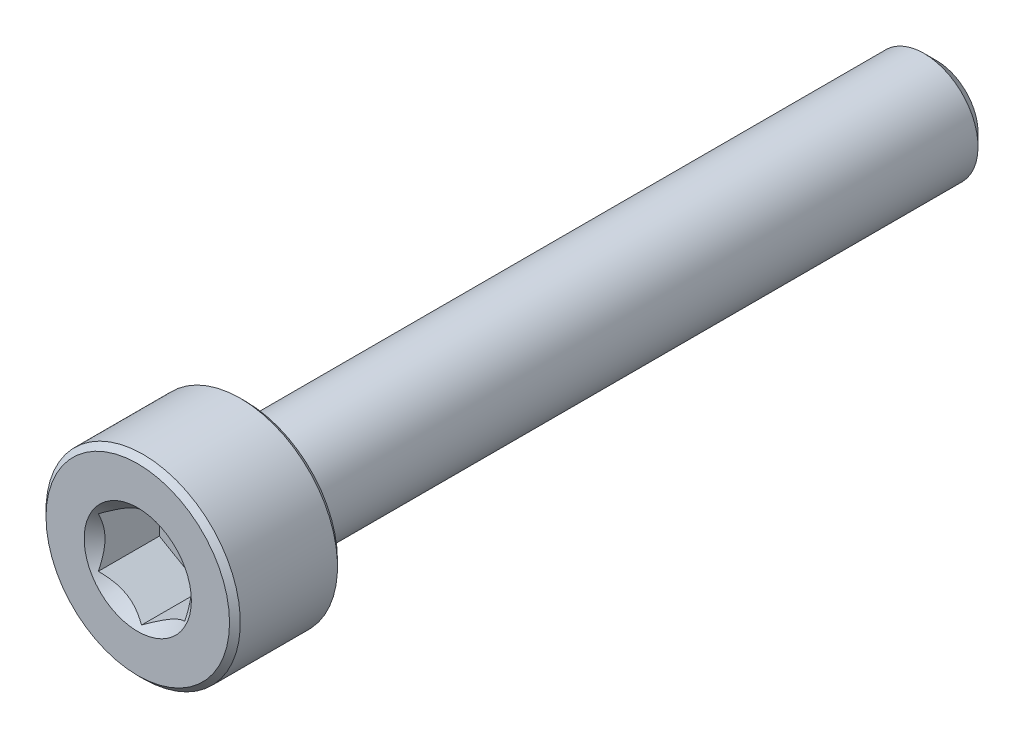
ISO-10303-21;
HEADER;
FILE_DESCRIPTION(('STEP AP214'),'2;1');
FILE_NAME('part.step','',(''),(''),'','','');
FILE_SCHEMA(('AUTOMOTIVE_DESIGN { 1 0 10303 214 1 1 1 1 }'));
ENDSEC;
DATA;
#1=APPLICATION_CONTEXT('core data for automotive mechanical design processes');
#2=APPLICATION_PROTOCOL_DEFINITION('international standard','automotive_design',2000,#1);
#3=PRODUCT_CONTEXT('',#1,'mechanical');
#4=PRODUCT('Part','Part','',(#3));
#5=PRODUCT_RELATED_PRODUCT_CATEGORY('part','',(#4));
#6=PRODUCT_DEFINITION_FORMATION('','',#4);
#7=PRODUCT_DEFINITION_CONTEXT('part definition',#1,'design');
#8=PRODUCT_DEFINITION('design','',#6,#7);
#9=PRODUCT_DEFINITION_SHAPE('','',#8);
#10=(LENGTH_UNIT() NAMED_UNIT(*) SI_UNIT(.MILLI.,.METRE.));
#11=(NAMED_UNIT(*) PLANE_ANGLE_UNIT() SI_UNIT($,.RADIAN.));
#12=(NAMED_UNIT(*) SI_UNIT($,.STERADIAN.) SOLID_ANGLE_UNIT());
#13=UNCERTAINTY_MEASURE_WITH_UNIT(LENGTH_MEASURE(1.E-05),#10,'distance_accuracy_value','');
#14=(GEOMETRIC_REPRESENTATION_CONTEXT(3) GLOBAL_UNCERTAINTY_ASSIGNED_CONTEXT((#13)) GLOBAL_UNIT_ASSIGNED_CONTEXT((#10,
#11,#12)) REPRESENTATION_CONTEXT('',''));
#15=CARTESIAN_POINT('',(0.,0.,0.));
#16=DIRECTION('',(0.,0.,1.));
#17=DIRECTION('',(1.,0.,0.));
#18=AXIS2_PLACEMENT_3D('',#15,#16,#17);
#19=CARTESIAN_POINT('',(0.,0.957716426222752,-9.25));
#20=DIRECTION('',(0.,0.,-1.));
#21=DIRECTION('',(0.,1.,0.));
#22=AXIS2_PLACEMENT_3D('',#19,#20,#21);
#23=PLANE('',#22);
#24=CARTESIAN_POINT('',(0.,0.,-9.25));
#25=DIRECTION('',(0.,0.,-1.));
#26=DIRECTION('',(0.,1.,0.));
#27=AXIS2_PLACEMENT_3D('',#24,#25,#26);
#28=CIRCLE('',#27,0.957716426222752);
#29=CARTESIAN_POINT('',(0.,0.957716426222752,-9.25));
#30=VERTEX_POINT('',#29);
#31=EDGE_CURVE('E57',#30,#30,#28,.T.);
#32=ORIENTED_EDGE('',*,*,#31,.T.);
#33=EDGE_LOOP('',(#32));
#34=FACE_BOUND('',#33,.T.);
#35=ADVANCED_FACE('F43',(#34),#23,.T.);
#36=CARTESIAN_POINT('',(0.,0.,-9.25));
#37=DIRECTION('',(0.,0.,1.));
#38=DIRECTION('',(0.,-1.,0.));
#39=AXIS2_PLACEMENT_3D('',#36,#37,#38);
#40=CONICAL_SURFACE('',#39,0.957716426222752,0.785398163397447);
#41=CARTESIAN_POINT('',(0.,0.,-8.95771642622275));
#42=DIRECTION('',(0.,0.,-1.));
#43=DIRECTION('',(0.,1.,0.));
#44=AXIS2_PLACEMENT_3D('',#41,#42,#43);
#45=CIRCLE('',#44,1.25);
#46=CARTESIAN_POINT('',(0.,1.25,-8.95771642622275));
#47=VERTEX_POINT('',#46);
#48=EDGE_CURVE('E175',#47,#47,#45,.T.);
#49=ORIENTED_EDGE('',*,*,#48,.T.);
#50=EDGE_LOOP('',(#49));
#51=FACE_BOUND('',#50,.T.);
#52=ORIENTED_EDGE('',*,*,#31,.F.);
#53=EDGE_LOOP('',(#52));
#54=FACE_BOUND('',#53,.T.);
#55=ADVANCED_FACE('F183',(#51,#54),#40,.T.);
#56=CARTESIAN_POINT('',(0.,0.,-9.25));
#57=DIRECTION('',(0.,0.,-1.));
#58=DIRECTION('',(0.,1.,0.));
#59=AXIS2_PLACEMENT_3D('',#56,#57,#58);
#60=CYLINDRICAL_SURFACE('',#59,1.25);
#61=CARTESIAN_POINT('',(0.,0.,6.625));
#62=DIRECTION('',(0.,0.,-1.));
#63=DIRECTION('',(0.,1.,0.));
#64=AXIS2_PLACEMENT_3D('',#61,#62,#63);
#65=CIRCLE('',#64,1.25);
#66=CARTESIAN_POINT('',(0.,1.25,6.625));
#67=VERTEX_POINT('',#66);
#68=EDGE_CURVE('E171',#67,#67,#65,.T.);
#69=ORIENTED_EDGE('',*,*,#68,.T.);
#70=EDGE_LOOP('',(#69));
#71=FACE_BOUND('',#70,.T.);
#72=ORIENTED_EDGE('',*,*,#48,.F.);
#73=EDGE_LOOP('',(#72));
#74=FACE_BOUND('',#73,.T.);
#75=ADVANCED_FACE('F185',(#71,#74),#60,.T.);
#76=CARTESIAN_POINT('',(0.,0.,6.625));
#77=DIRECTION('',(0.,0.,-1.));
#78=DIRECTION('',(0.,1.,0.));
#79=AXIS2_PLACEMENT_3D('',#76,#77,#78);
#80=TOROIDAL_SURFACE('',#79,1.375,0.125);
#81=CARTESIAN_POINT('',(0.,0.,6.75));
#82=DIRECTION('',(0.,0.,-1.));
#83=DIRECTION('',(0.,1.,0.));
#84=AXIS2_PLACEMENT_3D('',#81,#82,#83);
#85=CIRCLE('',#84,1.375);
#86=CARTESIAN_POINT('',(0.,1.375,6.75));
#87=VERTEX_POINT('',#86);
#88=EDGE_CURVE('E167',#87,#87,#85,.T.);
#89=ORIENTED_EDGE('',*,*,#88,.T.);
#90=EDGE_LOOP('',(#89));
#91=FACE_BOUND('',#90,.T.);
#92=ORIENTED_EDGE('',*,*,#68,.F.);
#93=EDGE_LOOP('',(#92));
#94=FACE_BOUND('',#93,.T.);
#95=ADVANCED_FACE('F191',(#91,#94),#80,.F.);
#96=CARTESIAN_POINT('',(0.,2.125,6.75));
#97=DIRECTION('',(0.,0.,-1.));
#98=DIRECTION('',(0.,1.,0.));
#99=AXIS2_PLACEMENT_3D('',#96,#97,#98);
#100=PLANE('',#99);
#101=CARTESIAN_POINT('',(0.,0.,6.75));
#102=DIRECTION('',(0.,0.,-1.));
#103=DIRECTION('',(0.,1.,0.));
#104=AXIS2_PLACEMENT_3D('',#101,#102,#103);
#105=CIRCLE('',#104,2.125);
#106=CARTESIAN_POINT('',(0.,2.125,6.75));
#107=VERTEX_POINT('',#106);
#108=EDGE_CURVE('E163',#107,#107,#105,.T.);
#109=ORIENTED_EDGE('',*,*,#108,.T.);
#110=EDGE_LOOP('',(#109));
#111=FACE_BOUND('',#110,.T.);
#112=ORIENTED_EDGE('',*,*,#88,.F.);
#113=EDGE_LOOP('',(#112));
#114=FACE_BOUND('',#113,.T.);
#115=ADVANCED_FACE('F197',(#111,#114),#100,.T.);
#116=CARTESIAN_POINT('',(0.,0.,6.75));
#117=DIRECTION('',(0.,0.,1.));
#118=DIRECTION('',(0.,-1.,0.));
#119=AXIS2_PLACEMENT_3D('',#116,#117,#118);
#120=CONICAL_SURFACE('',#119,2.125,0.78539816339745);
#121=CARTESIAN_POINT('',(0.,0.,6.875));
#122=DIRECTION('',(0.,0.,-1.));
#123=DIRECTION('',(0.,1.,0.));
#124=AXIS2_PLACEMENT_3D('',#121,#122,#123);
#125=CIRCLE('',#124,2.25);
#126=CARTESIAN_POINT('',(0.,2.25,6.875));
#127=VERTEX_POINT('',#126);
#128=EDGE_CURVE('E159',#127,#127,#125,.T.);
#129=ORIENTED_EDGE('',*,*,#128,.T.);
#130=EDGE_LOOP('',(#129));
#131=FACE_BOUND('',#130,.T.);
#132=ORIENTED_EDGE('',*,*,#108,.F.);
#133=EDGE_LOOP('',(#132));
#134=FACE_BOUND('',#133,.T.);
#135=ADVANCED_FACE('F201',(#131,#134),#120,.T.);
#136=CARTESIAN_POINT('',(0.,0.,-9.25));
#137=DIRECTION('',(0.,0.,-1.));
#138=DIRECTION('',(0.,1.,0.));
#139=AXIS2_PLACEMENT_3D('',#136,#137,#138);
#140=CYLINDRICAL_SURFACE('',#139,2.25);
#141=CARTESIAN_POINT('',(0.,0.,9.125));
#142=DIRECTION('',(0.,0.,-1.));
#143=DIRECTION('',(0.,1.,0.));
#144=AXIS2_PLACEMENT_3D('',#141,#142,#143);
#145=CIRCLE('',#144,2.25);
#146=CARTESIAN_POINT('',(0.,2.25,9.125));
#147=VERTEX_POINT('',#146);
#148=EDGE_CURVE('E155',#147,#147,#145,.T.);
#149=ORIENTED_EDGE('',*,*,#148,.T.);
#150=EDGE_LOOP('',(#149));
#151=FACE_BOUND('',#150,.T.);
#152=ORIENTED_EDGE('',*,*,#128,.F.);
#153=EDGE_LOOP('',(#152));
#154=FACE_BOUND('',#153,.T.);
#155=ADVANCED_FACE('F205',(#151,#154),#140,.T.);
#156=CARTESIAN_POINT('',(0.,0.,9.125));
#157=DIRECTION('',(0.,0.,-1.));
#158=DIRECTION('',(0.,1.,0.));
#159=AXIS2_PLACEMENT_3D('',#156,#157,#158);
#160=CONICAL_SURFACE('',#159,2.25,0.78539816339745);
#161=CARTESIAN_POINT('',(0.,0.,9.25));
#162=DIRECTION('',(0.,0.,-1.));
#163=DIRECTION('',(0.,1.,0.));
#164=AXIS2_PLACEMENT_3D('',#161,#162,#163);
#165=CIRCLE('',#164,2.125);
#166=CARTESIAN_POINT('',(0.,2.125,9.25));
#167=VERTEX_POINT('',#166);
#168=EDGE_CURVE('E151',#167,#167,#165,.T.);
#169=ORIENTED_EDGE('',*,*,#168,.T.);
#170=EDGE_LOOP('',(#169));
#171=FACE_BOUND('',#170,.T.);
#172=ORIENTED_EDGE('',*,*,#148,.F.);
#173=EDGE_LOOP('',(#172));
#174=FACE_BOUND('',#173,.T.);
#175=ADVANCED_FACE('F209',(#171,#174),#160,.T.);
#176=CARTESIAN_POINT('',(0.,0.,9.25));
#177=DIRECTION('',(0.,0.,1.));
#178=DIRECTION('',(0.,-1.,0.));
#179=AXIS2_PLACEMENT_3D('',#176,#177,#178);
#180=PLANE('',#179);
#181=CARTESIAN_POINT('',(0.,0.,9.25));
#182=DIRECTION('',(0.,0.,1.));
#183=DIRECTION('',(1.,0.,0.));
#184=AXIS2_PLACEMENT_3D('',#181,#182,#183);
#185=CIRCLE('',#184,1.2413030787577);
#186=CARTESIAN_POINT('',(1.2413030787577,0.,9.25));
#187=VERTEX_POINT('',#186);
#188=EDGE_CURVE('E117',#187,#187,#185,.T.);
#189=ORIENTED_EDGE('',*,*,#188,.F.);
#190=EDGE_LOOP('',(#189));
#191=FACE_BOUND('',#190,.T.);
#192=ORIENTED_EDGE('',*,*,#168,.F.);
#193=EDGE_LOOP('',(#192));
#194=FACE_BOUND('',#193,.T.);
#195=ADVANCED_FACE('F213',(#191,#194),#180,.T.);
#196=CARTESIAN_POINT('',(0.,0.,9.25));
#197=DIRECTION('',(0.,0.,1.));
#198=DIRECTION('',(1.,0.,0.));
#199=AXIS2_PLACEMENT_3D('',#196,#197,#198);
#200=CONICAL_SURFACE('',#199,1.2413030787577,0.78539816339745);
#201=ORIENTED_EDGE('',*,*,#188,.T.);
#202=EDGE_LOOP('',(#201));
#203=FACE_BOUND('',#202,.T.);
#204=CARTESIAN_POINT('',(-0.00019999999999932,-1.15481600843309,9.16351294699417));
#205=CARTESIAN_POINT('',(0.0341825950071814,-1.13496520795026,9.14367539044729));
#206=CARTESIAN_POINT('',(0.0691401181398255,-1.11478247255942,9.12500248026045));
#207=CARTESIAN_POINT('',(0.14042280295609,-1.07362739529219,9.09081220234471));
#208=CARTESIAN_POINT('',(0.176754750528984,-1.0526511355808,9.07531386864501));
#209=CARTESIAN_POINT('',(0.250016613803311,-1.01035337909803,9.04876476676382));
#210=CARTESIAN_POINT('',(0.286927851445414,-0.989042666109241,9.03764723361848));
#211=CARTESIAN_POINT('',(0.36156272931086,-0.945952199282691,9.02051732539774));
#212=CARTESIAN_POINT('',(0.399284088108636,-0.924173762626596,9.01449215708823));
#213=CARTESIAN_POINT('',(0.464292198417934,-0.886641312640014,9.00905801458905));
#214=CARTESIAN_POINT('',(0.491494371528172,-0.870936130672275,9.00825439793829));
#215=CARTESIAN_POINT('',(0.545846040669112,-0.839556179862848,9.00960415903844));
#216=CARTESIAN_POINT('',(0.572995523754876,-0.823881418494923,9.01175818916876));
#217=CARTESIAN_POINT('',(0.654056277326961,-0.777080970599366,9.02251443175003));
#218=CARTESIAN_POINT('',(0.707564140978428,-0.74618819111643,9.03541201603691));
#219=CARTESIAN_POINT('',(0.801476065143432,-0.691968116419649,9.06653819022373));
#220=CARTESIAN_POINT('',(0.842320523671834,-0.668386557293372,9.08313525732339));
#221=CARTESIAN_POINT('',(0.922409637381943,-0.622147085933682,9.12052238430685));
#222=CARTESIAN_POINT('',(0.961659010870437,-0.599486449584575,9.14129880143896));
#223=CARTESIAN_POINT('',(1.0002,-0.577234799135788,9.16351294699417));
#224=B_SPLINE_CURVE_WITH_KNOTS('',3,(#204,#205,#206,#207,#208,#209,#210,#211,#212,#213,#214,
#215,#216,#217,#218,#219,#220,#221,#222,#223),.UNSPECIFIED.,.F.,.F.,(4,2,2,2,2,2,2,2,2,4),(0.,
0.133237676828559,0.267252229834489,0.399137076269299,0.530689603280768,0.624814864263846,
0.718960890149133,0.907306626112097,1.05710100361789,1.20641411519286),.UNSPECIFIED.);
#225=CARTESIAN_POINT('',(0.,-1.15470053837925,9.16339745962156));
#226=VERTEX_POINT('',#225);
#227=CARTESIAN_POINT('',(1.,-0.577350269189626,9.16339745962156));
#228=VERTEX_POINT('',#227);
#229=EDGE_CURVE('E12',#226,#228,#224,.T.);
#230=ORIENTED_EDGE('',*,*,#229,.F.);
#231=CARTESIAN_POINT('',(-1.0002,-0.577234799135788,9.16351294699417));
#232=CARTESIAN_POINT('',(-0.965817404992819,-0.597085599618622,9.14367539044729));
#233=CARTESIAN_POINT('',(-0.930859881860175,-0.617268335009456,9.12500248026045));
#234=CARTESIAN_POINT('',(-0.859577197043911,-0.658423412276686,9.09081220234471));
#235=CARTESIAN_POINT('',(-0.823245249471016,-0.67939967198808,9.07531386864501));
#236=CARTESIAN_POINT('',(-0.749983386196689,-0.721697428470846,9.04876476676382));
#237=CARTESIAN_POINT('',(-0.713072148554586,-0.743008141459636,9.03764723361848));
#238=CARTESIAN_POINT('',(-0.638437270689141,-0.786098608286186,9.02051732539774));
#239=CARTESIAN_POINT('',(-0.600715911891365,-0.807877044942281,9.01449215708823));
#240=CARTESIAN_POINT('',(-0.535707801582067,-0.845409494928862,9.00905801458905));
#241=CARTESIAN_POINT('',(-0.508505628471829,-0.861114676896601,9.00825439793829));
#242=CARTESIAN_POINT('',(-0.454153959330889,-0.892494627706028,9.00960415903844));
#243=CARTESIAN_POINT('',(-0.427004476245125,-0.908169389073953,9.01175818916876));
#244=CARTESIAN_POINT('',(-0.345943722673041,-0.95496983696951,9.02251443175003));
#245=CARTESIAN_POINT('',(-0.292435859021573,-0.985862616452447,9.03541201603691));
#246=CARTESIAN_POINT('',(-0.198523934856569,-1.04008269114923,9.06653819022373));
#247=CARTESIAN_POINT('',(-0.157679476328167,-1.06366425027551,9.08313525732339));
#248=CARTESIAN_POINT('',(-0.077590362618057,-1.1099037216352,9.12052238430685));
#249=CARTESIAN_POINT('',(-0.0383409891295627,-1.1325643579843,9.14129880143896));
#250=CARTESIAN_POINT('',(0.000200000000000142,-1.15481600843309,9.16351294699417));
#251=B_SPLINE_CURVE_WITH_KNOTS('',3,(#231,#232,#233,#234,#235,#236,#237,#238,#239,#240,#241,
#242,#243,#244,#245,#246,#247,#248,#249,#250),.UNSPECIFIED.,.F.,.F.,(4,2,2,2,2,2,2,2,2,4),(0.,
0.133237676828559,0.267252229834489,0.399137076269299,0.530689603280767,0.624814864263845,
0.718960890149132,0.907306626112096,1.05710100361789,1.20641411519286),.UNSPECIFIED.);
#252=CARTESIAN_POINT('',(-1.,-0.577350269189626,9.16339745962156));
#253=VERTEX_POINT('',#252);
#254=EDGE_CURVE('E102',#253,#226,#251,.T.);
#255=ORIENTED_EDGE('',*,*,#254,.F.);
#256=CARTESIAN_POINT('',(-1.,-1.21199087789934,9.57997725527287));
#257=CARTESIAN_POINT('',(-1.,-1.18273650300522,9.55741554693661));
#258=CARTESIAN_POINT('',(-1.,-1.15332592158341,9.53505703381193));
#259=CARTESIAN_POINT('',(-1.,-1.09412680336146,9.4908320719692));
#260=CARTESIAN_POINT('',(-1.,-1.06433818018076,9.46896573899681));
#261=CARTESIAN_POINT('',(-1.,-0.97387129354152,9.4039212875776));
#262=CARTESIAN_POINT('',(-1.,-0.912535008128868,9.3616436137258));
#263=CARTESIAN_POINT('',(-1.,-0.783508251342876,9.27806824785001));
#264=CARTESIAN_POINT('',(-1.,-0.715662620346607,9.23700761033256));
#265=CARTESIAN_POINT('',(-1.,-0.576509894905892,9.16150147066945));
#266=CARTESIAN_POINT('',(-1.,-0.505215555513883,9.12703362621591));
#267=CARTESIAN_POINT('',(-1.,-0.398764046939012,9.08484878246325));
#268=CARTESIAN_POINT('',(-1.,-0.365313297980423,9.07284938948254));
#269=CARTESIAN_POINT('',(-1.,-0.297551245132093,9.05153030995286));
#270=CARTESIAN_POINT('',(-1.,-0.263239887100778,9.04221079245893));
#271=CARTESIAN_POINT('',(-1.,-0.194571067470057,9.02691167587498));
#272=CARTESIAN_POINT('',(-1.,-0.160227555987668,9.02087048308474));
#273=CARTESIAN_POINT('',(-1.,-0.0910948269867773,9.01225224503757));
#274=CARTESIAN_POINT('',(-1.,-0.0563055613802764,9.00967557676501));
#275=CARTESIAN_POINT('',(-1.,0.0117927152654014,9.00821295512037));
#276=CARTESIAN_POINT('',(-1.,0.0450983170825071,9.00916703835344));
#277=CARTESIAN_POINT('',(-1.,0.111441413420383,9.01434362211099));
#278=CARTESIAN_POINT('',(-1.,0.144478971732107,9.01856532046785));
#279=CARTESIAN_POINT('',(-1.,0.210624763290572,9.03010847896862));
#280=CARTESIAN_POINT('',(-1.,0.243723154740698,9.03748543479042));
#281=CARTESIAN_POINT('',(-1.,0.309187738497536,9.05492899920948));
#282=CARTESIAN_POINT('',(-1.,0.341553969590706,9.06499546496534));
#283=CARTESIAN_POINT('',(-1.,0.440875348086756,9.09974257065232));
#284=CARTESIAN_POINT('',(-1.,0.506480526276306,9.1282699754181));
#285=CARTESIAN_POINT('',(-1.,0.634628446237199,9.19175922476326));
#286=CARTESIAN_POINT('',(-1.,0.697159414671817,9.22674368431451));
#287=CARTESIAN_POINT('',(-1.,0.816694357126199,9.29898555821879));
#288=CARTESIAN_POINT('',(-1.,0.873818851530729,9.33604607035743));
#289=CARTESIAN_POINT('',(-1.,0.957979712513755,9.39336695643995));
#290=CARTESIAN_POINT('',(-1.,0.985671461150837,9.41268175945423));
#291=CARTESIAN_POINT('',(-1.,1.04067496120981,9.45182989264588));
#292=CARTESIAN_POINT('',(-1.,1.06798681474316,9.47166307919343));
#293=CARTESIAN_POINT('',(-1.,1.09514019811391,9.49171143685736));
#294=B_SPLINE_CURVE_WITH_KNOTS('',3,(#256,#257,#258,#259,#260,#261,#262,#263,#264,#265,#266,
#267,#268,#269,#270,#271,#272,#273,#274,#275,#276,#277,#278,#279,#280,#281,#282,#283,#284,#285,
#286,#287,#288,#289,#290,#291,#292,#293),.UNSPECIFIED.,.F.,.F.,(4,2,2,2,2,2,2,2,2,2,2,2,2,2,2,2,
2,2,4),(0.,0.110828944200309,0.221683685263868,0.445078388583646,0.682811068621038,
0.919723239940849,1.02624790401867,1.13277928653702,1.23723298361625,1.34169804566788,
1.44148938783186,1.54125623996228,1.64285505347063,1.74444847208079,1.95844200767913,
2.17319976124347,2.3773768581412,2.47865984803709,2.57991506662171),.UNSPECIFIED.);
#295=CARTESIAN_POINT('',(-1.,0.577350269189626,9.16339745962156));
#296=VERTEX_POINT('',#295);
#297=EDGE_CURVE('E116',#296,#253,#294,.F.);
#298=ORIENTED_EDGE('',*,*,#297,.F.);
#299=CARTESIAN_POINT('',(0.000199999999999444,1.15481600843309,9.16351294699417));
#300=CARTESIAN_POINT('',(-0.0341825950071814,1.13496520795026,9.14367539044729));
#301=CARTESIAN_POINT('',(-0.0691401181398255,1.11478247255942,9.12500248026045));
#302=CARTESIAN_POINT('',(-0.14042280295609,1.07362739529219,9.09081220234471));
#303=CARTESIAN_POINT('',(-0.176754750528984,1.0526511355808,9.07531386864501));
#304=CARTESIAN_POINT('',(-0.250016613803311,1.01035337909803,9.04876476676382));
#305=CARTESIAN_POINT('',(-0.286927851445415,0.989042666109241,9.03764723361848));
#306=CARTESIAN_POINT('',(-0.36156272931086,0.945952199282691,9.02051732539774));
#307=CARTESIAN_POINT('',(-0.399284088108636,0.924173762626596,9.01449215708823));
#308=CARTESIAN_POINT('',(-0.464292198417934,0.886641312640014,9.00905801458905));
#309=CARTESIAN_POINT('',(-0.491494371528172,0.870936130672275,9.00825439793829));
#310=CARTESIAN_POINT('',(-0.545846040669112,0.839556179862848,9.00960415903844));
#311=CARTESIAN_POINT('',(-0.572995523754876,0.823881418494923,9.01175818916876));
#312=CARTESIAN_POINT('',(-0.65405627732696,0.777080970599366,9.02251443175003));
#313=CARTESIAN_POINT('',(-0.707564140978428,0.74618819111643,9.03541201603691));
#314=CARTESIAN_POINT('',(-0.801476065143431,0.691968116419649,9.06653819022373));
#315=CARTESIAN_POINT('',(-0.842320523671834,0.668386557293372,9.08313525732339));
#316=CARTESIAN_POINT('',(-0.922409637381943,0.622147085933682,9.12052238430685));
#317=CARTESIAN_POINT('',(-0.961659010870437,0.599486449584575,9.14129880143896));
#318=CARTESIAN_POINT('',(-1.0002,0.577234799135788,9.16351294699417));
#319=B_SPLINE_CURVE_WITH_KNOTS('',3,(#299,#300,#301,#302,#303,#304,#305,#306,#307,#308,#309,
#310,#311,#312,#313,#314,#315,#316,#317,#318),.UNSPECIFIED.,.F.,.F.,(4,2,2,2,2,2,2,2,2,4),(0.,
0.133237676828559,0.26725222983449,0.3991370762693,0.530689603280768,0.624814864263846,
0.718960890149133,0.907306626112097,1.05710100361789,1.20641411519286),.UNSPECIFIED.);
#320=CARTESIAN_POINT('',(0.,1.15470053837925,9.16339745962156));
#321=VERTEX_POINT('',#320);
#322=EDGE_CURVE('E264',#321,#296,#319,.T.);
#323=ORIENTED_EDGE('',*,*,#322,.F.);
#324=CARTESIAN_POINT('',(1.0002,0.577234799135788,9.16351294699417));
#325=CARTESIAN_POINT('',(0.965817404992819,0.597085599618622,9.14367539044729));
#326=CARTESIAN_POINT('',(0.930859881860175,0.617268335009456,9.12500248026045));
#327=CARTESIAN_POINT('',(0.85957719704391,0.658423412276686,9.09081220234471));
#328=CARTESIAN_POINT('',(0.823245249471016,0.67939967198808,9.07531386864501));
#329=CARTESIAN_POINT('',(0.749983386196689,0.721697428470846,9.04876476676382));
#330=CARTESIAN_POINT('',(0.713072148554586,0.743008141459637,9.03764723361848));
#331=CARTESIAN_POINT('',(0.638437270689141,0.786098608286186,9.02051732539774));
#332=CARTESIAN_POINT('',(0.600715911891364,0.807877044942281,9.01449215708823));
#333=CARTESIAN_POINT('',(0.535707801582066,0.845409494928863,9.00905801458905));
#334=CARTESIAN_POINT('',(0.508505628471827,0.861114676896602,9.00825439793829));
#335=CARTESIAN_POINT('',(0.454153959330888,0.892494627706029,9.00960415903844));
#336=CARTESIAN_POINT('',(0.427004476245124,0.908169389073954,9.01175818916876));
#337=CARTESIAN_POINT('',(0.345943722673039,0.954969836969511,9.02251443175003));
#338=CARTESIAN_POINT('',(0.292435859021572,0.985862616452447,9.03541201603691));
#339=CARTESIAN_POINT('',(0.198523934856568,1.04008269114923,9.06653819022373));
#340=CARTESIAN_POINT('',(0.157679476328166,1.06366425027551,9.08313525732339));
#341=CARTESIAN_POINT('',(0.0775903626180565,1.1099037216352,9.12052238430685));
#342=CARTESIAN_POINT('',(0.0383409891295625,1.1325643579843,9.14129880143896));
#343=CARTESIAN_POINT('',(-0.000199999999999909,1.15481600843309,9.16351294699417));
#344=B_SPLINE_CURVE_WITH_KNOTS('',3,(#324,#325,#326,#327,#328,#329,#330,#331,#332,#333,#334,
#335,#336,#337,#338,#339,#340,#341,#342,#343),.UNSPECIFIED.,.F.,.F.,(4,2,2,2,2,2,2,2,2,4),(0.,
0.133237676828559,0.26725222983449,0.3991370762693,0.530689603280768,0.624814864263846,
0.718960890149133,0.907306626112097,1.05710100361789,1.20641411519286),.UNSPECIFIED.);
#345=CARTESIAN_POINT('',(1.,0.577350269189626,9.16339745962156));
#346=VERTEX_POINT('',#345);
#347=EDGE_CURVE('E237',#346,#321,#344,.T.);
#348=ORIENTED_EDGE('',*,*,#347,.F.);
#349=CARTESIAN_POINT('',(1.,-1.21199087789934,9.57997725527287));
#350=CARTESIAN_POINT('',(1.,-1.18273650300522,9.55741554693661));
#351=CARTESIAN_POINT('',(1.,-1.15332592158341,9.53505703381193));
#352=CARTESIAN_POINT('',(1.,-1.09412680336146,9.4908320719692));
#353=CARTESIAN_POINT('',(1.,-1.06433818018076,9.46896573899681));
#354=CARTESIAN_POINT('',(1.,-0.97387129354152,9.4039212875776));
#355=CARTESIAN_POINT('',(1.,-0.912535008128868,9.3616436137258));
#356=CARTESIAN_POINT('',(1.,-0.783508251342876,9.27806824785001));
#357=CARTESIAN_POINT('',(1.,-0.715662620346607,9.23700761033256));
#358=CARTESIAN_POINT('',(1.,-0.576509894905892,9.16150147066945));
#359=CARTESIAN_POINT('',(1.,-0.505215555513883,9.12703362621591));
#360=CARTESIAN_POINT('',(1.,-0.398764046939012,9.08484878246325));
#361=CARTESIAN_POINT('',(1.,-0.365313297980422,9.07284938948254));
#362=CARTESIAN_POINT('',(1.,-0.297551245132093,9.05153030995286));
#363=CARTESIAN_POINT('',(1.,-0.263239887100778,9.04221079245893));
#364=CARTESIAN_POINT('',(1.,-0.194571067470056,9.02691167587498));
#365=CARTESIAN_POINT('',(1.,-0.160227555987668,9.02087048308474));
#366=CARTESIAN_POINT('',(1.,-0.0910948269867767,9.01225224503757));
#367=CARTESIAN_POINT('',(1.,-0.0563055613802757,9.00967557676501));
#368=CARTESIAN_POINT('',(1.,0.0117927152654022,9.00821295512037));
#369=CARTESIAN_POINT('',(1.,0.0450983170825078,9.00916703835344));
#370=CARTESIAN_POINT('',(1.,0.111441413420384,9.01434362211099));
#371=CARTESIAN_POINT('',(1.,0.144478971732107,9.01856532046785));
#372=CARTESIAN_POINT('',(1.,0.210624763290572,9.03010847896862));
#373=CARTESIAN_POINT('',(1.,0.243723154740698,9.03748543479042));
#374=CARTESIAN_POINT('',(1.,0.309187738497536,9.05492899920948));
#375=CARTESIAN_POINT('',(1.,0.341553969590706,9.06499546496534));
#376=CARTESIAN_POINT('',(1.,0.440875348086756,9.09974257065232));
#377=CARTESIAN_POINT('',(1.,0.506480526276306,9.1282699754181));
#378=CARTESIAN_POINT('',(1.,0.634628446237199,9.19175922476326));
#379=CARTESIAN_POINT('',(1.,0.697159414671816,9.22674368431451));
#380=CARTESIAN_POINT('',(1.,0.816694357126198,9.29898555821879));
#381=CARTESIAN_POINT('',(1.,0.873818851530728,9.33604607035743));
#382=CARTESIAN_POINT('',(1.,0.957979712513756,9.39336695643995));
#383=CARTESIAN_POINT('',(1.,0.985671461150838,9.41268175945423));
#384=CARTESIAN_POINT('',(1.,1.04067496120981,9.45182989264588));
#385=CARTESIAN_POINT('',(1.,1.06798681474316,9.47166307919343));
#386=CARTESIAN_POINT('',(1.,1.09514019811391,9.49171143685736));
#387=B_SPLINE_CURVE_WITH_KNOTS('',3,(#349,#350,#351,#352,#353,#354,#355,#356,#357,#358,#359,
#360,#361,#362,#363,#364,#365,#366,#367,#368,#369,#370,#371,#372,#373,#374,#375,#376,#377,#378,
#379,#380,#381,#382,#383,#384,#385,#386),.UNSPECIFIED.,.F.,.F.,(4,2,2,2,2,2,2,2,2,2,2,2,2,2,2,2,
2,2,4),(0.,0.110828944200309,0.221683685263869,0.445078388583646,0.682811068621038,
0.919723239940849,1.02624790401867,1.13277928653702,1.23723298361625,1.34169804566788,
1.44148938783186,1.54125623996228,1.64285505347063,1.74444847208079,1.95844200767913,
2.17319976124347,2.3773768581412,2.47865984803709,2.57991506662171),.UNSPECIFIED.);
#388=EDGE_CURVE('E64',#228,#346,#387,.T.);
#389=ORIENTED_EDGE('',*,*,#388,.F.);
#390=EDGE_LOOP('',(#230,#255,#298,#323,#348,#389));
#391=FACE_BOUND('',#390,.T.);
#392=ADVANCED_FACE('F101',(#203,#391),#200,.F.);
#393=CARTESIAN_POINT('',(0.,2.125,7.75));
#394=DIRECTION('',(0.,0.,-1.));
#395=DIRECTION('',(0.,1.,0.));
#396=AXIS2_PLACEMENT_3D('',#393,#394,#395);
#397=PLANE('',#396);
#398=DIRECTION('',(0.866025403784438,0.5,0.));
#399=VECTOR('',#398,1.);
#400=CARTESIAN_POINT('',(0.,-1.15470053837925,7.75));
#401=LINE('',#400,#399);
#402=CARTESIAN_POINT('',(0.,-1.15470053837925,7.75));
#403=VERTEX_POINT('',#402);
#404=CARTESIAN_POINT('',(1.,-0.577350269189626,7.75));
#405=VERTEX_POINT('',#404);
#406=EDGE_CURVE('E120',#403,#405,#401,.T.);
#407=ORIENTED_EDGE('',*,*,#406,.T.);
#408=DIRECTION('',(0.,1.,0.));
#409=VECTOR('',#408,1.);
#410=CARTESIAN_POINT('',(1.,-0.577350269189626,7.75));
#411=LINE('',#410,#409);
#412=CARTESIAN_POINT('',(1.,0.577350269189626,7.75));
#413=VERTEX_POINT('',#412);
#414=EDGE_CURVE('E71',#405,#413,#411,.T.);
#415=ORIENTED_EDGE('',*,*,#414,.T.);
#416=DIRECTION('',(-0.866025403784439,0.5,0.));
#417=VECTOR('',#416,1.);
#418=CARTESIAN_POINT('',(1.,0.577350269189626,7.75));
#419=LINE('',#418,#417);
#420=CARTESIAN_POINT('',(0.,1.15470053837925,7.75));
#421=VERTEX_POINT('',#420);
#422=EDGE_CURVE('E131',#413,#421,#419,.T.);
#423=ORIENTED_EDGE('',*,*,#422,.T.);
#424=DIRECTION('',(-0.866025403784438,-0.5,0.));
#425=VECTOR('',#424,1.);
#426=CARTESIAN_POINT('',(0.,1.15470053837925,7.75));
#427=LINE('',#426,#425);
#428=CARTESIAN_POINT('',(-1.,0.577350269189626,7.75));
#429=VERTEX_POINT('',#428);
#430=EDGE_CURVE('E140',#421,#429,#427,.T.);
#431=ORIENTED_EDGE('',*,*,#430,.T.);
#432=DIRECTION('',(0.,-1.,0.));
#433=VECTOR('',#432,1.);
#434=CARTESIAN_POINT('',(-1.,0.577350269189626,7.75));
#435=LINE('',#434,#433);
#436=CARTESIAN_POINT('',(-1.,-0.577350269189626,7.75));
#437=VERTEX_POINT('',#436);
#438=EDGE_CURVE('E135',#429,#437,#435,.T.);
#439=ORIENTED_EDGE('',*,*,#438,.T.);
#440=DIRECTION('',(0.866025403784439,-0.5,0.));
#441=VECTOR('',#440,1.);
#442=CARTESIAN_POINT('',(-1.,-0.577350269189626,7.75));
#443=LINE('',#442,#441);
#444=EDGE_CURVE('E122',#437,#403,#443,.T.);
#445=ORIENTED_EDGE('',*,*,#444,.T.);
#446=EDGE_LOOP('',(#407,#415,#423,#431,#439,#445));
#447=FACE_BOUND('',#446,.T.);
#448=ADVANCED_FACE('F218',(#447),#397,.F.);
#449=CARTESIAN_POINT('',(0.,-1.15470053837925,3.69494953669611));
#450=DIRECTION('',(0.5,-0.866025403784438,0.));
#451=DIRECTION('',(0.866025403784438,0.5,0.));
#452=AXIS2_PLACEMENT_3D('',#449,#450,#451);
#453=PLANE('',#452);
#454=DIRECTION('',(0.,0.,1.));
#455=VECTOR('',#454,1.);
#456=CARTESIAN_POINT('',(0.,-1.15470053837925,3.69494953669611));
#457=LINE('',#456,#455);
#458=EDGE_CURVE('E111',#403,#226,#457,.T.);
#459=ORIENTED_EDGE('',*,*,#458,.T.);
#460=ORIENTED_EDGE('',*,*,#229,.T.);
#461=DIRECTION('',(0.,0.,1.));
#462=VECTOR('',#461,1.);
#463=CARTESIAN_POINT('',(1.,-0.577350269189626,3.69494953669611));
#464=LINE('',#463,#462);
#465=EDGE_CURVE('E126',#405,#228,#464,.T.);
#466=ORIENTED_EDGE('',*,*,#465,.F.);
#467=ORIENTED_EDGE('',*,*,#406,.F.);
#468=EDGE_LOOP('',(#459,#460,#466,#467));
#469=FACE_BOUND('',#468,.T.);
#470=ADVANCED_FACE('F119',(#469),#453,.F.);
#471=CARTESIAN_POINT('',(-1.,-0.577350269189626,3.69494953669611));
#472=DIRECTION('',(-0.5,-0.866025403784439,0.));
#473=DIRECTION('',(0.866025403784439,-0.5,0.));
#474=AXIS2_PLACEMENT_3D('',#471,#472,#473);
#475=PLANE('',#474);
#476=DIRECTION('',(0.,0.,1.));
#477=VECTOR('',#476,1.);
#478=CARTESIAN_POINT('',(-1.,-0.577350269189626,3.69494953669611));
#479=LINE('',#478,#477);
#480=EDGE_CURVE('E114',#437,#253,#479,.T.);
#481=ORIENTED_EDGE('',*,*,#480,.T.);
#482=ORIENTED_EDGE('',*,*,#254,.T.);
#483=ORIENTED_EDGE('',*,*,#458,.F.);
#484=ORIENTED_EDGE('',*,*,#444,.F.);
#485=EDGE_LOOP('',(#481,#482,#483,#484));
#486=FACE_BOUND('',#485,.T.);
#487=ADVANCED_FACE('F110',(#486),#475,.F.);
#488=CARTESIAN_POINT('',(-1.,0.577350269189626,3.69494953669611));
#489=DIRECTION('',(-1.,0.,0.));
#490=DIRECTION('',(0.,0.,1.));
#491=AXIS2_PLACEMENT_3D('',#488,#489,#490);
#492=PLANE('',#491);
#493=DIRECTION('',(0.,0.,1.));
#494=VECTOR('',#493,1.);
#495=CARTESIAN_POINT('',(-1.,0.577350269189626,3.69494953669611));
#496=LINE('',#495,#494);
#497=EDGE_CURVE('E136',#429,#296,#496,.T.);
#498=ORIENTED_EDGE('',*,*,#497,.T.);
#499=ORIENTED_EDGE('',*,*,#297,.T.);
#500=ORIENTED_EDGE('',*,*,#480,.F.);
#501=ORIENTED_EDGE('',*,*,#438,.F.);
#502=EDGE_LOOP('',(#498,#499,#500,#501));
#503=FACE_BOUND('',#502,.T.);
#504=ADVANCED_FACE('F274',(#503),#492,.F.);
#505=CARTESIAN_POINT('',(0.,1.15470053837925,3.69494953669611));
#506=DIRECTION('',(-0.5,0.866025403784438,0.));
#507=DIRECTION('',(-0.866025403784438,-0.5,0.));
#508=AXIS2_PLACEMENT_3D('',#505,#506,#507);
#509=PLANE('',#508);
#510=DIRECTION('',(0.,0.,1.));
#511=VECTOR('',#510,1.);
#512=CARTESIAN_POINT('',(0.,1.15470053837925,3.69494953669611));
#513=LINE('',#512,#511);
#514=EDGE_CURVE('E141',#421,#321,#513,.T.);
#515=ORIENTED_EDGE('',*,*,#514,.T.);
#516=ORIENTED_EDGE('',*,*,#322,.T.);
#517=ORIENTED_EDGE('',*,*,#497,.F.);
#518=ORIENTED_EDGE('',*,*,#430,.F.);
#519=EDGE_LOOP('',(#515,#516,#517,#518));
#520=FACE_BOUND('',#519,.T.);
#521=ADVANCED_FACE('F271',(#520),#509,.F.);
#522=CARTESIAN_POINT('',(1.,0.577350269189626,3.69494953669611));
#523=DIRECTION('',(0.5,0.866025403784439,0.));
#524=DIRECTION('',(-0.866025403784439,0.5,0.));
#525=AXIS2_PLACEMENT_3D('',#522,#523,#524);
#526=PLANE('',#525);
#527=DIRECTION('',(0.,0.,1.));
#528=VECTOR('',#527,1.);
#529=CARTESIAN_POINT('',(1.,0.577350269189626,3.69494953669611));
#530=LINE('',#529,#528);
#531=EDGE_CURVE('E145',#413,#346,#530,.T.);
#532=ORIENTED_EDGE('',*,*,#531,.T.);
#533=ORIENTED_EDGE('',*,*,#347,.T.);
#534=ORIENTED_EDGE('',*,*,#514,.F.);
#535=ORIENTED_EDGE('',*,*,#422,.F.);
#536=EDGE_LOOP('',(#532,#533,#534,#535));
#537=FACE_BOUND('',#536,.T.);
#538=ADVANCED_FACE('F226',(#537),#526,.F.);
#539=CARTESIAN_POINT('',(1.,-0.577350269189626,3.69494953669611));
#540=DIRECTION('',(1.,0.,0.));
#541=DIRECTION('',(0.,0.,-1.));
#542=AXIS2_PLACEMENT_3D('',#539,#540,#541);
#543=PLANE('',#542);
#544=ORIENTED_EDGE('',*,*,#465,.T.);
#545=ORIENTED_EDGE('',*,*,#388,.T.);
#546=ORIENTED_EDGE('',*,*,#531,.F.);
#547=ORIENTED_EDGE('',*,*,#414,.F.);
#548=EDGE_LOOP('',(#544,#545,#546,#547));
#549=FACE_BOUND('',#548,.T.);
#550=ADVANCED_FACE('F222',(#549),#543,.F.);
#551=CLOSED_SHELL('',(#35,#55,#75,#95,#115,#135,#155,#175,#195,#392,#448,#470,#487,#504,#521,
#538,#550));
#552=MANIFOLD_SOLID_BREP('B2',#551);
#553=ADVANCED_BREP_SHAPE_REPRESENTATION('',(#18,#552),#14);
#554=SHAPE_DEFINITION_REPRESENTATION(#9,#553);
ENDSEC;
END-ISO-10303-21;
